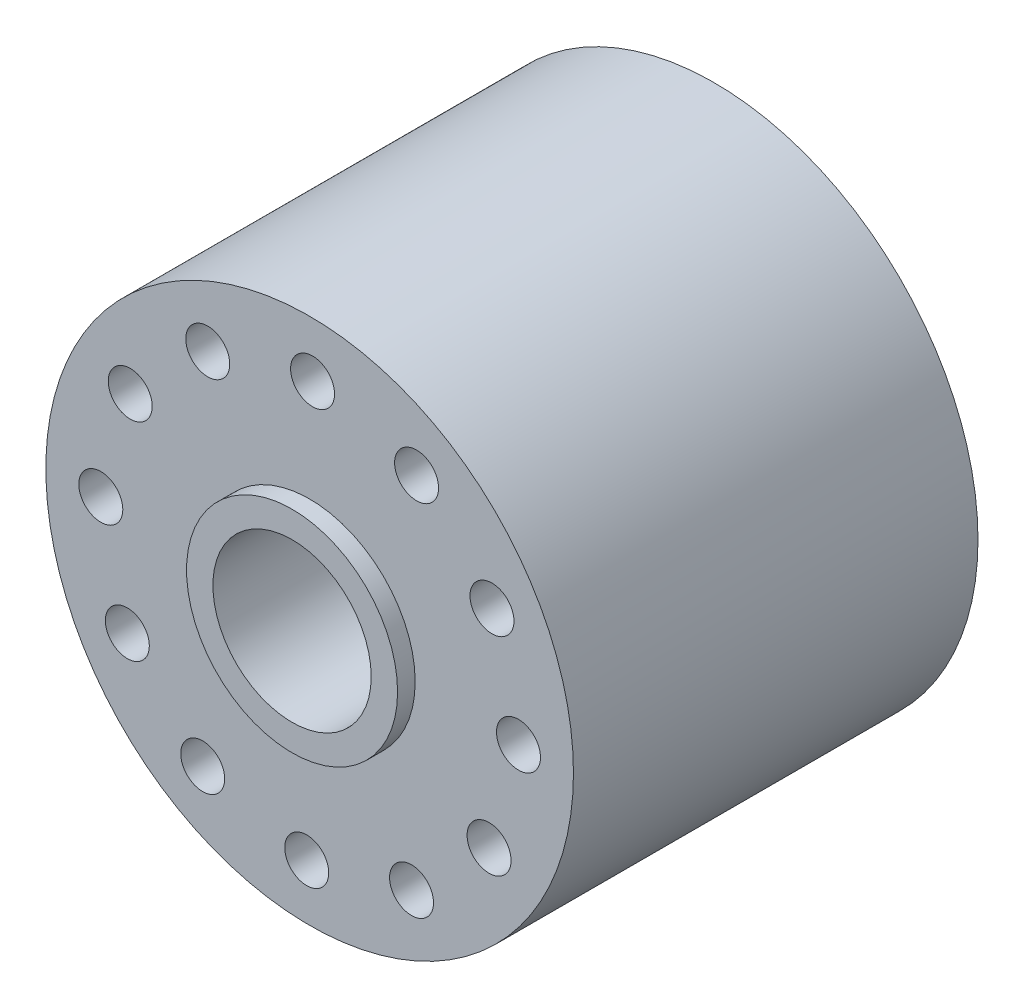
ISO-10303-21;
HEADER;
FILE_DESCRIPTION(('STEP AP214'),'2;1');
FILE_NAME('part.step','',(''),(''),'','','');
FILE_SCHEMA(('AUTOMOTIVE_DESIGN { 1 0 10303 214 1 1 1 1 }'));
ENDSEC;
DATA;
#1=APPLICATION_CONTEXT('core data for automotive mechanical design processes');
#2=APPLICATION_PROTOCOL_DEFINITION('international standard','automotive_design',2000,#1);
#3=PRODUCT_CONTEXT('',#1,'mechanical');
#4=PRODUCT('Part','Part','',(#3));
#5=PRODUCT_RELATED_PRODUCT_CATEGORY('part','',(#4));
#6=PRODUCT_DEFINITION_FORMATION('','',#4);
#7=PRODUCT_DEFINITION_CONTEXT('part definition',#1,'design');
#8=PRODUCT_DEFINITION('design','',#6,#7);
#9=PRODUCT_DEFINITION_SHAPE('','',#8);
#10=(LENGTH_UNIT() NAMED_UNIT(*) SI_UNIT(.MILLI.,.METRE.));
#11=(NAMED_UNIT(*) PLANE_ANGLE_UNIT() SI_UNIT($,.RADIAN.));
#12=(NAMED_UNIT(*) SI_UNIT($,.STERADIAN.) SOLID_ANGLE_UNIT());
#13=UNCERTAINTY_MEASURE_WITH_UNIT(LENGTH_MEASURE(1.E-05),#10,'distance_accuracy_value','');
#14=(GEOMETRIC_REPRESENTATION_CONTEXT(3) GLOBAL_UNCERTAINTY_ASSIGNED_CONTEXT((#13)) GLOBAL_UNIT_ASSIGNED_CONTEXT((#10,
#11,#12)) REPRESENTATION_CONTEXT('',''));
#15=CARTESIAN_POINT('',(0.,0.,0.));
#16=DIRECTION('',(0.,0.,1.));
#17=DIRECTION('',(1.,0.,0.));
#18=AXIS2_PLACEMENT_3D('',#15,#16,#17);
#19=CARTESIAN_POINT('',(0.,0.,23.));
#20=DIRECTION('',(0.,0.,1.));
#21=DIRECTION('',(1.,0.,0.));
#22=AXIS2_PLACEMENT_3D('',#19,#20,#21);
#23=PLANE('',#22);
#24=CARTESIAN_POINT('',(0.330787080657206,23.7476963073743,23.));
#25=DIRECTION('',(0.,0.,1.));
#26=DIRECTION('',(1.,0.,0.));
#27=AXIS2_PLACEMENT_3D('',#24,#25,#26);
#28=CIRCLE('',#27,2.50000000000195);
#29=CARTESIAN_POINT('',(2.83078708065915,23.7476963073743,23.));
#30=VERTEX_POINT('',#29);
#31=EDGE_CURVE('E110',#30,#30,#28,.T.);
#32=ORIENTED_EDGE('',*,*,#31,.F.);
#33=EDGE_LOOP('',(#32));
#34=FACE_BOUND('',#33,.T.);
#35=CARTESIAN_POINT('',(-23.7476963073733,0.330787080656168,23.));
#36=DIRECTION('',(0.,0.,1.));
#37=DIRECTION('',(1.,0.,0.));
#38=AXIS2_PLACEMENT_3D('',#35,#36,#37);
#39=CIRCLE('',#38,2.50000000000347);
#40=CARTESIAN_POINT('',(-21.2476963073698,0.330787080656168,23.));
#41=VERTEX_POINT('',#40);
#42=EDGE_CURVE('E98',#41,#41,#39,.T.);
#43=ORIENTED_EDGE('',*,*,#42,.F.);
#44=EDGE_LOOP('',(#43));
#45=FACE_BOUND('',#44,.T.);
#46=CARTESIAN_POINT('',(-12.1603181687781,-20.400714743216,23.));
#47=DIRECTION('',(0.,0.,1.));
#48=DIRECTION('',(1.,0.,0.));
#49=AXIS2_PLACEMENT_3D('',#46,#47,#48);
#50=CIRCLE('',#49,2.5000000000041);
#51=CARTESIAN_POINT('',(-9.66031816877398,-20.400714743216,23.));
#52=VERTEX_POINT('',#51);
#53=EDGE_CURVE('E86',#52,#52,#50,.T.);
#54=ORIENTED_EDGE('',*,*,#53,.F.);
#55=EDGE_LOOP('',(#54));
#56=FACE_BOUND('',#55,.T.);
#57=CARTESIAN_POINT('',(11.5873781385962,-20.7315018238721,23.));
#58=DIRECTION('',(0.,0.,1.));
#59=DIRECTION('',(1.,0.,0.));
#60=AXIS2_PLACEMENT_3D('',#57,#58,#59);
#61=CIRCLE('',#60,2.50000000000373);
#62=CARTESIAN_POINT('',(14.0873781385999,-20.7315018238721,23.));
#63=VERTEX_POINT('',#62);
#64=EDGE_CURVE('E74',#63,#63,#61,.T.);
#65=ORIENTED_EDGE('',*,*,#64,.F.);
#66=EDGE_LOOP('',(#65));
#67=FACE_BOUND('',#66,.T.);
#68=CARTESIAN_POINT('',(23.7476963073753,-0.330787080656212,23.));
#69=DIRECTION('',(0.,0.,1.));
#70=DIRECTION('',(1.,0.,0.));
#71=AXIS2_PLACEMENT_3D('',#68,#69,#70);
#72=CIRCLE('',#71,2.50000000000267);
#73=CARTESIAN_POINT('',(26.247696307378,-0.330787080656212,23.));
#74=VERTEX_POINT('',#73);
#75=EDGE_CURVE('E62',#74,#74,#72,.T.);
#76=ORIENTED_EDGE('',*,*,#75,.F.);
#77=EDGE_LOOP('',(#76));
#78=FACE_BOUND('',#77,.T.);
#79=CARTESIAN_POINT('',(12.16031816878,20.4007147432154,23.));
#80=DIRECTION('',(0.,0.,1.));
#81=DIRECTION('',(1.,0.,0.));
#82=AXIS2_PLACEMENT_3D('',#79,#80,#81);
#83=CIRCLE('',#82,2.50000000000195);
#84=CARTESIAN_POINT('',(14.6603181687819,20.4007147432154,23.));
#85=VERTEX_POINT('',#84);
#86=EDGE_CURVE('E52',#85,#85,#83,.T.);
#87=ORIENTED_EDGE('',*,*,#86,.F.);
#88=EDGE_LOOP('',(#87));
#89=FACE_BOUND('',#88,.T.);
#90=CARTESIAN_POINT('',(0.,0.,23.));
#91=DIRECTION('',(0.,0.,1.));
#92=DIRECTION('',(1.,0.,0.));
#93=AXIS2_PLACEMENT_3D('',#90,#91,#92);
#94=CIRCLE('',#93,30.);
#95=CARTESIAN_POINT('',(30.,0.,23.));
#96=VERTEX_POINT('',#95);
#97=EDGE_CURVE('E10',#96,#96,#94,.T.);
#98=ORIENTED_EDGE('',*,*,#97,.T.);
#99=EDGE_LOOP('',(#98));
#100=FACE_BOUND('',#99,.T.);
#101=CARTESIAN_POINT('',(0.,0.,23.));
#102=DIRECTION('',(0.,0.,1.));
#103=DIRECTION('',(1.,0.,0.));
#104=AXIS2_PLACEMENT_3D('',#101,#102,#103);
#105=CIRCLE('',#104,12.);
#106=CARTESIAN_POINT('',(12.,0.,23.));
#107=VERTEX_POINT('',#106);
#108=EDGE_CURVE('E48',#107,#107,#105,.T.);
#109=ORIENTED_EDGE('',*,*,#108,.F.);
#110=EDGE_LOOP('',(#109));
#111=FACE_BOUND('',#110,.T.);
#112=CARTESIAN_POINT('',(20.7315018238731,11.5873781385952,23.));
#113=DIRECTION('',(0.,0.,1.));
#114=DIRECTION('',(1.,0.,0.));
#115=AXIS2_PLACEMENT_3D('',#112,#113,#114);
#116=CIRCLE('',#115,2.50000000000221);
#117=CARTESIAN_POINT('',(23.2315018238753,11.5873781385952,23.));
#118=VERTEX_POINT('',#117);
#119=EDGE_CURVE('E56',#118,#118,#116,.T.);
#120=ORIENTED_EDGE('',*,*,#119,.F.);
#121=EDGE_LOOP('',(#120));
#122=FACE_BOUND('',#121,.T.);
#123=CARTESIAN_POINT('',(20.400714743217,-12.1603181687791,23.));
#124=DIRECTION('',(0.,0.,1.));
#125=DIRECTION('',(1.,0.,0.));
#126=AXIS2_PLACEMENT_3D('',#123,#124,#125);
#127=CIRCLE('',#126,2.50000000000323);
#128=CARTESIAN_POINT('',(22.9007147432202,-12.1603181687791,23.));
#129=VERTEX_POINT('',#128);
#130=EDGE_CURVE('E68',#129,#129,#127,.T.);
#131=ORIENTED_EDGE('',*,*,#130,.F.);
#132=EDGE_LOOP('',(#131));
#133=FACE_BOUND('',#132,.T.);
#134=CARTESIAN_POINT('',(-0.330787080655177,-23.7476963073743,23.));
#135=DIRECTION('',(0.,0.,1.));
#136=DIRECTION('',(1.,0.,0.));
#137=AXIS2_PLACEMENT_3D('',#134,#135,#136);
#138=CIRCLE('',#137,2.50000000000403);
#139=CARTESIAN_POINT('',(2.16921291934885,-23.7476963073743,23.));
#140=VERTEX_POINT('',#139);
#141=EDGE_CURVE('E80',#140,#140,#138,.T.);
#142=ORIENTED_EDGE('',*,*,#141,.F.);
#143=EDGE_LOOP('',(#142));
#144=FACE_BOUND('',#143,.T.);
#145=CARTESIAN_POINT('',(-20.7315018238711,-11.5873781385952,23.));
#146=DIRECTION('',(0.,0.,1.));
#147=DIRECTION('',(1.,0.,0.));
#148=AXIS2_PLACEMENT_3D('',#145,#146,#147);
#149=CIRCLE('',#148,2.50000000000388);
#150=CARTESIAN_POINT('',(-18.2315018238672,-11.5873781385952,23.));
#151=VERTEX_POINT('',#150);
#152=EDGE_CURVE('E92',#151,#151,#149,.T.);
#153=ORIENTED_EDGE('',*,*,#152,.F.);
#154=EDGE_LOOP('',(#153));
#155=FACE_BOUND('',#154,.T.);
#156=CARTESIAN_POINT('',(-20.4007147432149,12.1603181687791,23.));
#157=DIRECTION('',(0.,0.,1.));
#158=DIRECTION('',(1.,0.,0.));
#159=AXIS2_PLACEMENT_3D('',#156,#157,#158);
#160=CIRCLE('',#159,2.50000000000298);
#161=CARTESIAN_POINT('',(-17.9007147432119,12.1603181687791,23.));
#162=VERTEX_POINT('',#161);
#163=EDGE_CURVE('E104',#162,#162,#160,.T.);
#164=ORIENTED_EDGE('',*,*,#163,.F.);
#165=EDGE_LOOP('',(#164));
#166=FACE_BOUND('',#165,.T.);
#167=CARTESIAN_POINT('',(-11.5873781385942,20.7315018238721,23.));
#168=DIRECTION('',(0.,0.,1.));
#169=DIRECTION('',(1.,0.,0.));
#170=AXIS2_PLACEMENT_3D('',#167,#168,#169);
#171=CIRCLE('',#170,2.50000000000253);
#172=CARTESIAN_POINT('',(-9.08737813859165,20.7315018238721,23.));
#173=VERTEX_POINT('',#172);
#174=EDGE_CURVE('E116',#173,#173,#171,.T.);
#175=ORIENTED_EDGE('',*,*,#174,.F.);
#176=EDGE_LOOP('',(#175));
#177=FACE_BOUND('',#176,.T.);
#178=ADVANCED_FACE('F37',(#34,#45,#56,#67,#78,#89,#100,#111,#122,#133,#144,#155,#166,#177),#23,.T.);
#179=CARTESIAN_POINT('',(0.,0.,-23.));
#180=DIRECTION('',(0.,0.,1.));
#181=DIRECTION('',(1.,0.,0.));
#182=AXIS2_PLACEMENT_3D('',#179,#180,#181);
#183=PLANE('',#182);
#184=CARTESIAN_POINT('',(0.,0.,-23.));
#185=DIRECTION('',(0.,0.,1.));
#186=DIRECTION('',(1.,0.,0.));
#187=AXIS2_PLACEMENT_3D('',#184,#185,#186);
#188=CIRCLE('',#187,30.);
#189=CARTESIAN_POINT('',(30.,0.,-23.));
#190=VERTEX_POINT('',#189);
#191=EDGE_CURVE('E41',#190,#190,#188,.T.);
#192=ORIENTED_EDGE('',*,*,#191,.F.);
#193=EDGE_LOOP('',(#192));
#194=FACE_BOUND('',#193,.T.);
#195=CARTESIAN_POINT('',(0.,0.,-23.));
#196=DIRECTION('',(0.,0.,1.));
#197=DIRECTION('',(1.,0.,0.));
#198=AXIS2_PLACEMENT_3D('',#195,#196,#197);
#199=CIRCLE('',#198,12.);
#200=CARTESIAN_POINT('',(12.,0.,-23.));
#201=VERTEX_POINT('',#200);
#202=EDGE_CURVE('E122',#201,#201,#199,.F.);
#203=ORIENTED_EDGE('',*,*,#202,.F.);
#204=EDGE_LOOP('',(#203));
#205=FACE_BOUND('',#204,.T.);
#206=CARTESIAN_POINT('',(12.16031816878,20.4007147432154,-23.));
#207=DIRECTION('',(0.,0.,1.));
#208=DIRECTION('',(1.,0.,0.));
#209=AXIS2_PLACEMENT_3D('',#206,#207,#208);
#210=CIRCLE('',#209,2.50000000000195);
#211=CARTESIAN_POINT('',(14.6603181687819,20.4007147432154,-23.));
#212=VERTEX_POINT('',#211);
#213=EDGE_CURVE('E53',#212,#212,#210,.T.);
#214=ORIENTED_EDGE('',*,*,#213,.T.);
#215=EDGE_LOOP('',(#214));
#216=FACE_BOUND('',#215,.T.);
#217=CARTESIAN_POINT('',(20.7315018238731,11.5873781385952,-23.));
#218=DIRECTION('',(0.,0.,1.));
#219=DIRECTION('',(1.,0.,0.));
#220=AXIS2_PLACEMENT_3D('',#217,#218,#219);
#221=CIRCLE('',#220,2.50000000000221);
#222=CARTESIAN_POINT('',(23.2315018238753,11.5873781385952,-23.));
#223=VERTEX_POINT('',#222);
#224=EDGE_CURVE('E59',#223,#223,#221,.T.);
#225=ORIENTED_EDGE('',*,*,#224,.T.);
#226=EDGE_LOOP('',(#225));
#227=FACE_BOUND('',#226,.T.);
#228=CARTESIAN_POINT('',(23.7476963073753,-0.330787080656212,-23.));
#229=DIRECTION('',(0.,0.,1.));
#230=DIRECTION('',(1.,0.,0.));
#231=AXIS2_PLACEMENT_3D('',#228,#229,#230);
#232=CIRCLE('',#231,2.50000000000267);
#233=CARTESIAN_POINT('',(26.247696307378,-0.330787080656212,-23.));
#234=VERTEX_POINT('',#233);
#235=EDGE_CURVE('E65',#234,#234,#232,.T.);
#236=ORIENTED_EDGE('',*,*,#235,.T.);
#237=EDGE_LOOP('',(#236));
#238=FACE_BOUND('',#237,.T.);
#239=CARTESIAN_POINT('',(20.400714743217,-12.1603181687791,-23.));
#240=DIRECTION('',(0.,0.,1.));
#241=DIRECTION('',(1.,0.,0.));
#242=AXIS2_PLACEMENT_3D('',#239,#240,#241);
#243=CIRCLE('',#242,2.50000000000323);
#244=CARTESIAN_POINT('',(22.9007147432202,-12.1603181687791,-23.));
#245=VERTEX_POINT('',#244);
#246=EDGE_CURVE('E71',#245,#245,#243,.T.);
#247=ORIENTED_EDGE('',*,*,#246,.T.);
#248=EDGE_LOOP('',(#247));
#249=FACE_BOUND('',#248,.T.);
#250=CARTESIAN_POINT('',(11.5873781385962,-20.7315018238721,-23.));
#251=DIRECTION('',(0.,0.,1.));
#252=DIRECTION('',(1.,0.,0.));
#253=AXIS2_PLACEMENT_3D('',#250,#251,#252);
#254=CIRCLE('',#253,2.50000000000373);
#255=CARTESIAN_POINT('',(14.0873781385999,-20.7315018238721,-23.));
#256=VERTEX_POINT('',#255);
#257=EDGE_CURVE('E77',#256,#256,#254,.T.);
#258=ORIENTED_EDGE('',*,*,#257,.T.);
#259=EDGE_LOOP('',(#258));
#260=FACE_BOUND('',#259,.T.);
#261=CARTESIAN_POINT('',(-0.330787080655177,-23.7476963073743,-23.));
#262=DIRECTION('',(0.,0.,1.));
#263=DIRECTION('',(1.,0.,0.));
#264=AXIS2_PLACEMENT_3D('',#261,#262,#263);
#265=CIRCLE('',#264,2.50000000000403);
#266=CARTESIAN_POINT('',(2.16921291934885,-23.7476963073743,-23.));
#267=VERTEX_POINT('',#266);
#268=EDGE_CURVE('E83',#267,#267,#265,.T.);
#269=ORIENTED_EDGE('',*,*,#268,.T.);
#270=EDGE_LOOP('',(#269));
#271=FACE_BOUND('',#270,.T.);
#272=CARTESIAN_POINT('',(-12.1603181687781,-20.400714743216,-23.));
#273=DIRECTION('',(0.,0.,1.));
#274=DIRECTION('',(1.,0.,0.));
#275=AXIS2_PLACEMENT_3D('',#272,#273,#274);
#276=CIRCLE('',#275,2.5000000000041);
#277=CARTESIAN_POINT('',(-9.66031816877398,-20.400714743216,-23.));
#278=VERTEX_POINT('',#277);
#279=EDGE_CURVE('E89',#278,#278,#276,.T.);
#280=ORIENTED_EDGE('',*,*,#279,.T.);
#281=EDGE_LOOP('',(#280));
#282=FACE_BOUND('',#281,.T.);
#283=CARTESIAN_POINT('',(-20.7315018238711,-11.5873781385952,-23.));
#284=DIRECTION('',(0.,0.,1.));
#285=DIRECTION('',(1.,0.,0.));
#286=AXIS2_PLACEMENT_3D('',#283,#284,#285);
#287=CIRCLE('',#286,2.50000000000388);
#288=CARTESIAN_POINT('',(-18.2315018238672,-11.5873781385952,-23.));
#289=VERTEX_POINT('',#288);
#290=EDGE_CURVE('E95',#289,#289,#287,.T.);
#291=ORIENTED_EDGE('',*,*,#290,.T.);
#292=EDGE_LOOP('',(#291));
#293=FACE_BOUND('',#292,.T.);
#294=CARTESIAN_POINT('',(-23.7476963073733,0.330787080656168,-23.));
#295=DIRECTION('',(0.,0.,1.));
#296=DIRECTION('',(1.,0.,0.));
#297=AXIS2_PLACEMENT_3D('',#294,#295,#296);
#298=CIRCLE('',#297,2.50000000000347);
#299=CARTESIAN_POINT('',(-21.2476963073698,0.330787080656168,-23.));
#300=VERTEX_POINT('',#299);
#301=EDGE_CURVE('E101',#300,#300,#298,.T.);
#302=ORIENTED_EDGE('',*,*,#301,.T.);
#303=EDGE_LOOP('',(#302));
#304=FACE_BOUND('',#303,.T.);
#305=CARTESIAN_POINT('',(-20.4007147432149,12.1603181687791,-23.));
#306=DIRECTION('',(0.,0.,1.));
#307=DIRECTION('',(1.,0.,0.));
#308=AXIS2_PLACEMENT_3D('',#305,#306,#307);
#309=CIRCLE('',#308,2.50000000000298);
#310=CARTESIAN_POINT('',(-17.9007147432119,12.1603181687791,-23.));
#311=VERTEX_POINT('',#310);
#312=EDGE_CURVE('E107',#311,#311,#309,.T.);
#313=ORIENTED_EDGE('',*,*,#312,.T.);
#314=EDGE_LOOP('',(#313));
#315=FACE_BOUND('',#314,.T.);
#316=CARTESIAN_POINT('',(0.330787080657206,23.7476963073743,-23.));
#317=DIRECTION('',(0.,0.,1.));
#318=DIRECTION('',(1.,0.,0.));
#319=AXIS2_PLACEMENT_3D('',#316,#317,#318);
#320=CIRCLE('',#319,2.50000000000195);
#321=CARTESIAN_POINT('',(2.83078708065915,23.7476963073743,-23.));
#322=VERTEX_POINT('',#321);
#323=EDGE_CURVE('E113',#322,#322,#320,.T.);
#324=ORIENTED_EDGE('',*,*,#323,.T.);
#325=EDGE_LOOP('',(#324));
#326=FACE_BOUND('',#325,.T.);
#327=CARTESIAN_POINT('',(-11.5873781385942,20.7315018238721,-23.));
#328=DIRECTION('',(0.,0.,1.));
#329=DIRECTION('',(1.,0.,0.));
#330=AXIS2_PLACEMENT_3D('',#327,#328,#329);
#331=CIRCLE('',#330,2.50000000000253);
#332=CARTESIAN_POINT('',(-9.08737813859165,20.7315018238721,-23.));
#333=VERTEX_POINT('',#332);
#334=EDGE_CURVE('E119',#333,#333,#331,.T.);
#335=ORIENTED_EDGE('',*,*,#334,.T.);
#336=EDGE_LOOP('',(#335));
#337=FACE_BOUND('',#336,.T.);
#338=ADVANCED_FACE('F161',(#194,#205,#216,#227,#238,#249,#260,#271,#282,#293,#304,#315,#326,
#337),#183,.F.);
#339=CARTESIAN_POINT('',(0.,0.,23.));
#340=DIRECTION('',(0.,0.,-1.));
#341=DIRECTION('',(-1.,0.,0.));
#342=AXIS2_PLACEMENT_3D('',#339,#340,#341);
#343=CYLINDRICAL_SURFACE('',#342,30.);
#344=ORIENTED_EDGE('',*,*,#97,.F.);
#345=EDGE_LOOP('',(#344));
#346=FACE_BOUND('',#345,.T.);
#347=ORIENTED_EDGE('',*,*,#191,.T.);
#348=EDGE_LOOP('',(#347));
#349=FACE_BOUND('',#348,.T.);
#350=ADVANCED_FACE('F39',(#346,#349),#343,.T.);
#351=CARTESIAN_POINT('',(12.16031816878,20.4007147432154,23.));
#352=DIRECTION('',(0.,0.,-1.));
#353=DIRECTION('',(-1.,0.,0.));
#354=AXIS2_PLACEMENT_3D('',#351,#352,#353);
#355=CYLINDRICAL_SURFACE('',#354,2.50000000000195);
#356=ORIENTED_EDGE('',*,*,#86,.T.);
#357=EDGE_LOOP('',(#356));
#358=FACE_BOUND('',#357,.T.);
#359=ORIENTED_EDGE('',*,*,#213,.F.);
#360=EDGE_LOOP('',(#359));
#361=FACE_BOUND('',#360,.T.);
#362=ADVANCED_FACE('F171',(#358,#361),#355,.F.);
#363=CARTESIAN_POINT('',(20.7315018238731,11.5873781385952,23.));
#364=DIRECTION('',(0.,0.,-1.));
#365=DIRECTION('',(-1.,0.,0.));
#366=AXIS2_PLACEMENT_3D('',#363,#364,#365);
#367=CYLINDRICAL_SURFACE('',#366,2.50000000000221);
#368=ORIENTED_EDGE('',*,*,#119,.T.);
#369=EDGE_LOOP('',(#368));
#370=FACE_BOUND('',#369,.T.);
#371=ORIENTED_EDGE('',*,*,#224,.F.);
#372=EDGE_LOOP('',(#371));
#373=FACE_BOUND('',#372,.T.);
#374=ADVANCED_FACE('F174',(#370,#373),#367,.F.);
#375=CARTESIAN_POINT('',(23.7476963073753,-0.330787080656212,23.));
#376=DIRECTION('',(0.,0.,-1.));
#377=DIRECTION('',(-1.,0.,0.));
#378=AXIS2_PLACEMENT_3D('',#375,#376,#377);
#379=CYLINDRICAL_SURFACE('',#378,2.50000000000267);
#380=ORIENTED_EDGE('',*,*,#75,.T.);
#381=EDGE_LOOP('',(#380));
#382=FACE_BOUND('',#381,.T.);
#383=ORIENTED_EDGE('',*,*,#235,.F.);
#384=EDGE_LOOP('',(#383));
#385=FACE_BOUND('',#384,.T.);
#386=ADVANCED_FACE('F178',(#382,#385),#379,.F.);
#387=CARTESIAN_POINT('',(20.400714743217,-12.1603181687791,23.));
#388=DIRECTION('',(0.,0.,-1.));
#389=DIRECTION('',(-1.,0.,0.));
#390=AXIS2_PLACEMENT_3D('',#387,#388,#389);
#391=CYLINDRICAL_SURFACE('',#390,2.50000000000323);
#392=ORIENTED_EDGE('',*,*,#130,.T.);
#393=EDGE_LOOP('',(#392));
#394=FACE_BOUND('',#393,.T.);
#395=ORIENTED_EDGE('',*,*,#246,.F.);
#396=EDGE_LOOP('',(#395));
#397=FACE_BOUND('',#396,.T.);
#398=ADVANCED_FACE('F182',(#394,#397),#391,.F.);
#399=CARTESIAN_POINT('',(11.5873781385962,-20.7315018238721,23.));
#400=DIRECTION('',(0.,0.,-1.));
#401=DIRECTION('',(-1.,0.,0.));
#402=AXIS2_PLACEMENT_3D('',#399,#400,#401);
#403=CYLINDRICAL_SURFACE('',#402,2.50000000000373);
#404=ORIENTED_EDGE('',*,*,#64,.T.);
#405=EDGE_LOOP('',(#404));
#406=FACE_BOUND('',#405,.T.);
#407=ORIENTED_EDGE('',*,*,#257,.F.);
#408=EDGE_LOOP('',(#407));
#409=FACE_BOUND('',#408,.T.);
#410=ADVANCED_FACE('F186',(#406,#409),#403,.F.);
#411=CARTESIAN_POINT('',(-0.330787080655177,-23.7476963073743,23.));
#412=DIRECTION('',(0.,0.,-1.));
#413=DIRECTION('',(-1.,0.,0.));
#414=AXIS2_PLACEMENT_3D('',#411,#412,#413);
#415=CYLINDRICAL_SURFACE('',#414,2.50000000000403);
#416=ORIENTED_EDGE('',*,*,#141,.T.);
#417=EDGE_LOOP('',(#416));
#418=FACE_BOUND('',#417,.T.);
#419=ORIENTED_EDGE('',*,*,#268,.F.);
#420=EDGE_LOOP('',(#419));
#421=FACE_BOUND('',#420,.T.);
#422=ADVANCED_FACE('F190',(#418,#421),#415,.F.);
#423=CARTESIAN_POINT('',(-12.1603181687781,-20.400714743216,23.));
#424=DIRECTION('',(0.,0.,-1.));
#425=DIRECTION('',(-1.,0.,0.));
#426=AXIS2_PLACEMENT_3D('',#423,#424,#425);
#427=CYLINDRICAL_SURFACE('',#426,2.5000000000041);
#428=ORIENTED_EDGE('',*,*,#53,.T.);
#429=EDGE_LOOP('',(#428));
#430=FACE_BOUND('',#429,.T.);
#431=ORIENTED_EDGE('',*,*,#279,.F.);
#432=EDGE_LOOP('',(#431));
#433=FACE_BOUND('',#432,.T.);
#434=ADVANCED_FACE('F194',(#430,#433),#427,.F.);
#435=CARTESIAN_POINT('',(-20.7315018238711,-11.5873781385952,23.));
#436=DIRECTION('',(0.,0.,-1.));
#437=DIRECTION('',(-1.,0.,0.));
#438=AXIS2_PLACEMENT_3D('',#435,#436,#437);
#439=CYLINDRICAL_SURFACE('',#438,2.50000000000388);
#440=ORIENTED_EDGE('',*,*,#152,.T.);
#441=EDGE_LOOP('',(#440));
#442=FACE_BOUND('',#441,.T.);
#443=ORIENTED_EDGE('',*,*,#290,.F.);
#444=EDGE_LOOP('',(#443));
#445=FACE_BOUND('',#444,.T.);
#446=ADVANCED_FACE('F198',(#442,#445),#439,.F.);
#447=CARTESIAN_POINT('',(-23.7476963073733,0.330787080656168,23.));
#448=DIRECTION('',(0.,0.,-1.));
#449=DIRECTION('',(-1.,0.,0.));
#450=AXIS2_PLACEMENT_3D('',#447,#448,#449);
#451=CYLINDRICAL_SURFACE('',#450,2.50000000000347);
#452=ORIENTED_EDGE('',*,*,#42,.T.);
#453=EDGE_LOOP('',(#452));
#454=FACE_BOUND('',#453,.T.);
#455=ORIENTED_EDGE('',*,*,#301,.F.);
#456=EDGE_LOOP('',(#455));
#457=FACE_BOUND('',#456,.T.);
#458=ADVANCED_FACE('F202',(#454,#457),#451,.F.);
#459=CARTESIAN_POINT('',(-20.4007147432149,12.1603181687791,23.));
#460=DIRECTION('',(0.,0.,-1.));
#461=DIRECTION('',(-1.,0.,0.));
#462=AXIS2_PLACEMENT_3D('',#459,#460,#461);
#463=CYLINDRICAL_SURFACE('',#462,2.50000000000298);
#464=ORIENTED_EDGE('',*,*,#163,.T.);
#465=EDGE_LOOP('',(#464));
#466=FACE_BOUND('',#465,.T.);
#467=ORIENTED_EDGE('',*,*,#312,.F.);
#468=EDGE_LOOP('',(#467));
#469=FACE_BOUND('',#468,.T.);
#470=ADVANCED_FACE('F206',(#466,#469),#463,.F.);
#471=CARTESIAN_POINT('',(0.330787080657206,23.7476963073743,23.));
#472=DIRECTION('',(0.,0.,-1.));
#473=DIRECTION('',(-1.,0.,0.));
#474=AXIS2_PLACEMENT_3D('',#471,#472,#473);
#475=CYLINDRICAL_SURFACE('',#474,2.50000000000195);
#476=ORIENTED_EDGE('',*,*,#31,.T.);
#477=EDGE_LOOP('',(#476));
#478=FACE_BOUND('',#477,.T.);
#479=ORIENTED_EDGE('',*,*,#323,.F.);
#480=EDGE_LOOP('',(#479));
#481=FACE_BOUND('',#480,.T.);
#482=ADVANCED_FACE('F210',(#478,#481),#475,.F.);
#483=CARTESIAN_POINT('',(-11.5873781385942,20.7315018238721,23.));
#484=DIRECTION('',(0.,0.,-1.));
#485=DIRECTION('',(-1.,0.,0.));
#486=AXIS2_PLACEMENT_3D('',#483,#484,#485);
#487=CYLINDRICAL_SURFACE('',#486,2.50000000000253);
#488=ORIENTED_EDGE('',*,*,#174,.T.);
#489=EDGE_LOOP('',(#488));
#490=FACE_BOUND('',#489,.T.);
#491=ORIENTED_EDGE('',*,*,#334,.F.);
#492=EDGE_LOOP('',(#491));
#493=FACE_BOUND('',#492,.T.);
#494=ADVANCED_FACE('F156',(#490,#493),#487,.F.);
#495=CARTESIAN_POINT('',(0.,0.,25.));
#496=DIRECTION('',(0.,0.,-1.));
#497=DIRECTION('',(-1.,0.,0.));
#498=AXIS2_PLACEMENT_3D('',#495,#496,#497);
#499=CYLINDRICAL_SURFACE('',#498,12.);
#500=CARTESIAN_POINT('',(0.,0.,-25.));
#501=DIRECTION('',(0.,0.,1.));
#502=DIRECTION('',(1.,0.,0.));
#503=AXIS2_PLACEMENT_3D('',#500,#501,#502);
#504=CIRCLE('',#503,12.);
#505=CARTESIAN_POINT('',(12.,0.,-25.));
#506=VERTEX_POINT('',#505);
#507=EDGE_CURVE('E128',#506,#506,#504,.T.);
#508=ORIENTED_EDGE('',*,*,#507,.T.);
#509=EDGE_LOOP('',(#508));
#510=FACE_BOUND('',#509,.T.);
#511=ORIENTED_EDGE('',*,*,#202,.T.);
#512=EDGE_LOOP('',(#511));
#513=FACE_BOUND('',#512,.T.);
#514=ADVANCED_FACE('F146',(#510,#513),#499,.T.);
#515=CARTESIAN_POINT('',(0.,0.,25.));
#516=DIRECTION('',(0.,0.,1.));
#517=DIRECTION('',(1.,0.,0.));
#518=AXIS2_PLACEMENT_3D('',#515,#516,#517);
#519=PLANE('',#518);
#520=CARTESIAN_POINT('',(0.,0.,25.));
#521=DIRECTION('',(0.,0.,1.));
#522=DIRECTION('',(1.,0.,0.));
#523=AXIS2_PLACEMENT_3D('',#520,#521,#522);
#524=CIRCLE('',#523,12.);
#525=CARTESIAN_POINT('',(12.,0.,25.));
#526=VERTEX_POINT('',#525);
#527=EDGE_CURVE('E127',#526,#526,#524,.T.);
#528=ORIENTED_EDGE('',*,*,#527,.T.);
#529=EDGE_LOOP('',(#528));
#530=FACE_BOUND('',#529,.T.);
#531=CARTESIAN_POINT('',(0.,0.,25.));
#532=DIRECTION('',(0.,0.,1.));
#533=DIRECTION('',(1.,0.,0.));
#534=AXIS2_PLACEMENT_3D('',#531,#532,#533);
#535=CIRCLE('',#534,9.);
#536=CARTESIAN_POINT('',(9.,0.,25.));
#537=VERTEX_POINT('',#536);
#538=EDGE_CURVE('E131',#537,#537,#535,.T.);
#539=ORIENTED_EDGE('',*,*,#538,.F.);
#540=EDGE_LOOP('',(#539));
#541=FACE_BOUND('',#540,.T.);
#542=ADVANCED_FACE('F143',(#530,#541),#519,.T.);
#543=CARTESIAN_POINT('',(0.,0.,-25.));
#544=DIRECTION('',(0.,0.,1.));
#545=DIRECTION('',(1.,0.,0.));
#546=AXIS2_PLACEMENT_3D('',#543,#544,#545);
#547=PLANE('',#546);
#548=ORIENTED_EDGE('',*,*,#507,.F.);
#549=EDGE_LOOP('',(#548));
#550=FACE_BOUND('',#549,.T.);
#551=CARTESIAN_POINT('',(0.,0.,-25.));
#552=DIRECTION('',(0.,0.,1.));
#553=DIRECTION('',(1.,0.,0.));
#554=AXIS2_PLACEMENT_3D('',#551,#552,#553);
#555=CIRCLE('',#554,9.);
#556=CARTESIAN_POINT('',(9.,0.,-25.));
#557=VERTEX_POINT('',#556);
#558=EDGE_CURVE('E134',#557,#557,#555,.T.);
#559=ORIENTED_EDGE('',*,*,#558,.T.);
#560=EDGE_LOOP('',(#559));
#561=FACE_BOUND('',#560,.T.);
#562=ADVANCED_FACE('F145',(#550,#561),#547,.F.);
#563=ORIENTED_EDGE('',*,*,#108,.T.);
#564=EDGE_LOOP('',(#563));
#565=FACE_BOUND('',#564,.T.);
#566=ORIENTED_EDGE('',*,*,#527,.F.);
#567=EDGE_LOOP('',(#566));
#568=FACE_BOUND('',#567,.T.);
#569=ADVANCED_FACE('F153',(#565,#568),#499,.T.);
#570=CARTESIAN_POINT('',(0.,0.,25.));
#571=DIRECTION('',(0.,0.,-1.));
#572=DIRECTION('',(-1.,0.,0.));
#573=AXIS2_PLACEMENT_3D('',#570,#571,#572);
#574=CYLINDRICAL_SURFACE('',#573,9.);
#575=ORIENTED_EDGE('',*,*,#538,.T.);
#576=EDGE_LOOP('',(#575));
#577=FACE_BOUND('',#576,.T.);
#578=ORIENTED_EDGE('',*,*,#558,.F.);
#579=EDGE_LOOP('',(#578));
#580=FACE_BOUND('',#579,.T.);
#581=ADVANCED_FACE('F140',(#577,#580),#574,.F.);
#582=CLOSED_SHELL('',(#178,#338,#350,#362,#374,#386,#398,#410,#422,#434,#446,#458,#470,#482,
#494,#514,#542,#562,#569,#581));
#583=MANIFOLD_SOLID_BREP('B2',#582);
#584=ADVANCED_BREP_SHAPE_REPRESENTATION('',(#18,#583),#14);
#585=SHAPE_DEFINITION_REPRESENTATION(#9,#584);
ENDSEC;
END-ISO-10303-21;
